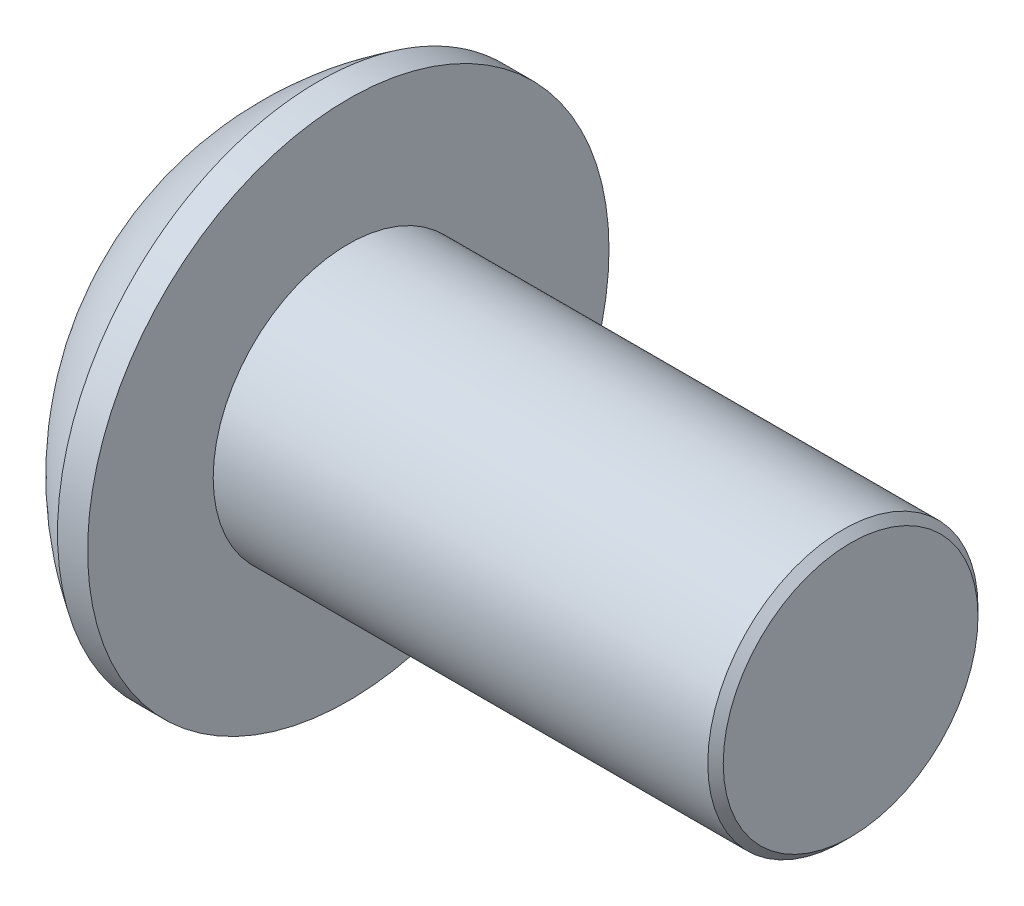
ISO-10303-21;
HEADER;
FILE_DESCRIPTION(('STEP AP214'),'2;1');
FILE_NAME('part.step','',(''),(''),'','','');
FILE_SCHEMA(('AUTOMOTIVE_DESIGN { 1 0 10303 214 1 1 1 1 }'));
ENDSEC;
DATA;
#1=APPLICATION_CONTEXT('core data for automotive mechanical design processes');
#2=APPLICATION_PROTOCOL_DEFINITION('international standard','automotive_design',2000,#1);
#3=PRODUCT_CONTEXT('',#1,'mechanical');
#4=PRODUCT('Part','Part','',(#3));
#5=PRODUCT_RELATED_PRODUCT_CATEGORY('part','',(#4));
#6=PRODUCT_DEFINITION_FORMATION('','',#4);
#7=PRODUCT_DEFINITION_CONTEXT('part definition',#1,'design');
#8=PRODUCT_DEFINITION('design','',#6,#7);
#9=PRODUCT_DEFINITION_SHAPE('','',#8);
#10=(LENGTH_UNIT() NAMED_UNIT(*) SI_UNIT(.MILLI.,.METRE.));
#11=(NAMED_UNIT(*) PLANE_ANGLE_UNIT() SI_UNIT($,.RADIAN.));
#12=(NAMED_UNIT(*) SI_UNIT($,.STERADIAN.) SOLID_ANGLE_UNIT());
#13=UNCERTAINTY_MEASURE_WITH_UNIT(LENGTH_MEASURE(1.E-05),#10,'distance_accuracy_value','');
#14=(GEOMETRIC_REPRESENTATION_CONTEXT(3) GLOBAL_UNCERTAINTY_ASSIGNED_CONTEXT((#13)) GLOBAL_UNIT_ASSIGNED_CONTEXT((#10,
#11,#12)) REPRESENTATION_CONTEXT('',''));
#15=CARTESIAN_POINT('',(0.,0.,0.));
#16=DIRECTION('',(0.,0.,1.));
#17=DIRECTION('',(1.,0.,0.));
#18=AXIS2_PLACEMENT_3D('',#15,#16,#17);
#19=CARTESIAN_POINT('',(1.32080000000034,0.,0.));
#20=DIRECTION('',(-1.,0.,0.));
#21=DIRECTION('',(0.,0.,-1.));
#22=AXIS2_PLACEMENT_3D('',#19,#20,#21);
#23=CONICAL_SURFACE('',#22,1.1937999999998,1.04719755119608);
#24=CARTESIAN_POINT('',(2.01004075135902,0.,-4.44089209850063E-13));
#25=VERTEX_POINT('',#24);
#26=VERTEX_LOOP('',#25);
#27=FACE_BOUND('',#26,.T.);
#28=CARTESIAN_POINT('',(1.32080000000009,0.,0.));
#29=DIRECTION('',(1.,0.,0.));
#30=DIRECTION('',(0.,0.,-1.));
#31=AXIS2_PLACEMENT_3D('',#28,#29,#30);
#32=CIRCLE('',#31,1.19380000000024);
#33=CARTESIAN_POINT('',(1.32080000000004,-1.03386112703797,-0.596900000000061));
#34=VERTEX_POINT('',#33);
#35=CARTESIAN_POINT('',(1.32080000000004,0.,-1.19380000000012));
#36=VERTEX_POINT('',#35);
#37=EDGE_CURVE('E40',#34,#36,#32,.T.);
#38=ORIENTED_EDGE('',*,*,#37,.F.);
#39=CARTESIAN_POINT('',(1.32080000000009,0.,0.));
#40=DIRECTION('',(1.,0.,0.));
#41=DIRECTION('',(0.,0.,-1.));
#42=AXIS2_PLACEMENT_3D('',#39,#40,#41);
#43=CIRCLE('',#42,1.19380000000024);
#44=CARTESIAN_POINT('',(1.32080000000004,-1.03386112703797,0.596900000000061));
#45=VERTEX_POINT('',#44);
#46=EDGE_CURVE('E130',#45,#34,#43,.T.);
#47=ORIENTED_EDGE('',*,*,#46,.F.);
#48=CARTESIAN_POINT('',(1.32080000000009,0.,0.));
#49=DIRECTION('',(1.,0.,0.));
#50=DIRECTION('',(0.,0.,-1.));
#51=AXIS2_PLACEMENT_3D('',#48,#49,#50);
#52=CIRCLE('',#51,1.19380000000024);
#53=CARTESIAN_POINT('',(1.32080000000004,1.49457637585666E-12,1.19380000000012));
#54=VERTEX_POINT('',#53);
#55=EDGE_CURVE('E136',#54,#45,#52,.T.);
#56=ORIENTED_EDGE('',*,*,#55,.F.);
#57=CARTESIAN_POINT('',(1.32080000000009,0.,0.));
#58=DIRECTION('',(1.,0.,0.));
#59=DIRECTION('',(0.,0.,-1.));
#60=AXIS2_PLACEMENT_3D('',#57,#58,#59);
#61=CIRCLE('',#60,1.19380000000024);
#62=CARTESIAN_POINT('',(1.32080000000004,1.03386112703797,0.59690000000006));
#63=VERTEX_POINT('',#62);
#64=EDGE_CURVE('E150',#63,#54,#61,.T.);
#65=ORIENTED_EDGE('',*,*,#64,.F.);
#66=CARTESIAN_POINT('',(1.32080000000009,0.,0.));
#67=DIRECTION('',(1.,0.,0.));
#68=DIRECTION('',(0.,0.,-1.));
#69=AXIS2_PLACEMENT_3D('',#66,#67,#68);
#70=CIRCLE('',#69,1.19380000000024);
#71=CARTESIAN_POINT('',(1.32080000000004,1.03386112703797,-0.59690000000006));
#72=VERTEX_POINT('',#71);
#73=EDGE_CURVE('E143',#72,#63,#70,.T.);
#74=ORIENTED_EDGE('',*,*,#73,.F.);
#75=CARTESIAN_POINT('',(1.32080000000009,0.,0.));
#76=DIRECTION('',(1.,0.,0.));
#77=DIRECTION('',(0.,0.,-1.));
#78=AXIS2_PLACEMENT_3D('',#75,#76,#77);
#79=CIRCLE('',#78,1.19380000000024);
#80=EDGE_CURVE('E140',#36,#72,#79,.T.);
#81=ORIENTED_EDGE('',*,*,#80,.F.);
#82=EDGE_LOOP('',(#38,#47,#56,#65,#74,#81));
#83=FACE_BOUND('',#82,.T.);
#84=ADVANCED_FACE('F37',(#27,#83),#23,.F.);
#85=CARTESIAN_POINT('',(1.3208,-2.06772225407573,1.1938));
#86=DIRECTION('',(1.,0.,0.));
#87=DIRECTION('',(0.,0.,1.));
#88=AXIS2_PLACEMENT_3D('',#85,#86,#87);
#89=PLANE('',#88);
#90=DIRECTION('',(0.,0.5,-0.866025403784439));
#91=VECTOR('',#90,1.);
#92=CARTESIAN_POINT('',(1.3208,-1.37848150271715,0.));
#93=LINE('',#92,#91);
#94=CARTESIAN_POINT('',(1.3208,-0.689240751358575,-1.1938));
#95=VERTEX_POINT('',#94);
#96=EDGE_CURVE('E112',#95,#34,#93,.F.);
#97=ORIENTED_EDGE('',*,*,#96,.T.);
#98=ORIENTED_EDGE('',*,*,#37,.T.);
#99=DIRECTION('',(0.,1.,0.));
#100=VECTOR('',#99,1.);
#101=CARTESIAN_POINT('',(1.3208,-0.689240751358575,-1.1938));
#102=LINE('',#101,#100);
#103=EDGE_CURVE('E127',#36,#95,#102,.F.);
#104=ORIENTED_EDGE('',*,*,#103,.T.);
#105=EDGE_LOOP('',(#97,#98,#104));
#106=FACE_BOUND('',#105,.T.);
#107=ADVANCED_FACE('F124',(#106),#89,.F.);
#108=CARTESIAN_POINT('',(1.3208,-2.06772225407573,1.1938));
#109=DIRECTION('',(1.,0.,0.));
#110=DIRECTION('',(0.,0.,1.));
#111=AXIS2_PLACEMENT_3D('',#108,#109,#110);
#112=PLANE('',#111);
#113=DIRECTION('',(0.,-0.5,-0.866025403784439));
#114=VECTOR('',#113,1.);
#115=CARTESIAN_POINT('',(1.3208,-0.689240751358575,1.1938));
#116=LINE('',#115,#114);
#117=CARTESIAN_POINT('',(1.3208,-1.37848150271715,0.));
#118=VERTEX_POINT('',#117);
#119=EDGE_CURVE('E132',#118,#45,#116,.F.);
#120=ORIENTED_EDGE('',*,*,#119,.T.);
#121=ORIENTED_EDGE('',*,*,#46,.T.);
#122=DIRECTION('',(0.,0.5,-0.866025403784439));
#123=VECTOR('',#122,1.);
#124=CARTESIAN_POINT('',(1.3208,-1.37848150271715,0.));
#125=LINE('',#124,#123);
#126=EDGE_CURVE('E107',#34,#118,#125,.F.);
#127=ORIENTED_EDGE('',*,*,#126,.T.);
#128=EDGE_LOOP('',(#120,#121,#127));
#129=FACE_BOUND('',#128,.T.);
#130=ADVANCED_FACE('F131',(#129),#112,.F.);
#131=CARTESIAN_POINT('',(1.3208,-2.06772225407573,1.1938));
#132=DIRECTION('',(1.,0.,0.));
#133=DIRECTION('',(0.,0.,1.));
#134=AXIS2_PLACEMENT_3D('',#131,#132,#133);
#135=PLANE('',#134);
#136=DIRECTION('',(0.,1.,0.));
#137=VECTOR('',#136,1.);
#138=CARTESIAN_POINT('',(1.3208,0.689240751358575,1.1938));
#139=LINE('',#138,#137);
#140=CARTESIAN_POINT('',(1.3208,-0.689240751358575,1.1938));
#141=VERTEX_POINT('',#140);
#142=EDGE_CURVE('E168',#141,#54,#139,.T.);
#143=ORIENTED_EDGE('',*,*,#142,.T.);
#144=ORIENTED_EDGE('',*,*,#55,.T.);
#145=DIRECTION('',(0.,-0.5,-0.866025403784439));
#146=VECTOR('',#145,1.);
#147=CARTESIAN_POINT('',(1.3208,-0.689240751358575,1.1938));
#148=LINE('',#147,#146);
#149=EDGE_CURVE('E166',#45,#141,#148,.F.);
#150=ORIENTED_EDGE('',*,*,#149,.T.);
#151=EDGE_LOOP('',(#143,#144,#150));
#152=FACE_BOUND('',#151,.T.);
#153=ADVANCED_FACE('F165',(#152),#135,.F.);
#154=CARTESIAN_POINT('',(1.3208,-2.06772225407573,1.1938));
#155=DIRECTION('',(1.,0.,0.));
#156=DIRECTION('',(0.,0.,1.));
#157=AXIS2_PLACEMENT_3D('',#154,#155,#156);
#158=PLANE('',#157);
#159=DIRECTION('',(0.,-0.499999999999999,0.866025403784439));
#160=VECTOR('',#159,1.);
#161=CARTESIAN_POINT('',(1.3208,1.37848150271715,0.));
#162=LINE('',#161,#160);
#163=CARTESIAN_POINT('',(1.3208,0.689240751358575,1.1938));
#164=VERTEX_POINT('',#163);
#165=EDGE_CURVE('E175',#164,#63,#162,.F.);
#166=ORIENTED_EDGE('',*,*,#165,.T.);
#167=ORIENTED_EDGE('',*,*,#64,.T.);
#168=DIRECTION('',(0.,1.,0.));
#169=VECTOR('',#168,1.);
#170=CARTESIAN_POINT('',(1.3208,0.689240751358575,1.1938));
#171=LINE('',#170,#169);
#172=EDGE_CURVE('E173',#54,#164,#171,.T.);
#173=ORIENTED_EDGE('',*,*,#172,.T.);
#174=EDGE_LOOP('',(#166,#167,#173));
#175=FACE_BOUND('',#174,.T.);
#176=ADVANCED_FACE('F172',(#175),#158,.F.);
#177=CARTESIAN_POINT('',(1.3208,-2.06772225407573,1.1938));
#178=DIRECTION('',(1.,0.,0.));
#179=DIRECTION('',(0.,0.,1.));
#180=AXIS2_PLACEMENT_3D('',#177,#178,#179);
#181=PLANE('',#180);
#182=DIRECTION('',(0.,0.499999999999999,0.866025403784439));
#183=VECTOR('',#182,1.);
#184=CARTESIAN_POINT('',(1.3208,0.689240751358575,-1.1938));
#185=LINE('',#184,#183);
#186=CARTESIAN_POINT('',(1.3208,1.37848150271715,0.));
#187=VERTEX_POINT('',#186);
#188=EDGE_CURVE('E186',#187,#72,#185,.F.);
#189=ORIENTED_EDGE('',*,*,#188,.T.);
#190=ORIENTED_EDGE('',*,*,#73,.T.);
#191=DIRECTION('',(0.,-0.499999999999999,0.866025403784439));
#192=VECTOR('',#191,1.);
#193=CARTESIAN_POINT('',(1.3208,1.37848150271715,0.));
#194=LINE('',#193,#192);
#195=EDGE_CURVE('E178',#63,#187,#194,.F.);
#196=ORIENTED_EDGE('',*,*,#195,.T.);
#197=EDGE_LOOP('',(#189,#190,#196));
#198=FACE_BOUND('',#197,.T.);
#199=ADVANCED_FACE('F184',(#198),#181,.F.);
#200=CARTESIAN_POINT('',(1.3208,-2.06772225407573,1.1938));
#201=DIRECTION('',(1.,0.,0.));
#202=DIRECTION('',(0.,0.,1.));
#203=AXIS2_PLACEMENT_3D('',#200,#201,#202);
#204=PLANE('',#203);
#205=DIRECTION('',(0.,1.,0.));
#206=VECTOR('',#205,1.);
#207=CARTESIAN_POINT('',(1.3208,-0.689240751358575,-1.1938));
#208=LINE('',#207,#206);
#209=CARTESIAN_POINT('',(1.3208,0.689240751358575,-1.1938));
#210=VERTEX_POINT('',#209);
#211=EDGE_CURVE('E147',#210,#36,#208,.F.);
#212=ORIENTED_EDGE('',*,*,#211,.T.);
#213=ORIENTED_EDGE('',*,*,#80,.T.);
#214=DIRECTION('',(0.,0.499999999999999,0.866025403784439));
#215=VECTOR('',#214,1.);
#216=CARTESIAN_POINT('',(1.3208,0.689240751358575,-1.1938));
#217=LINE('',#216,#215);
#218=EDGE_CURVE('E188',#72,#210,#217,.F.);
#219=ORIENTED_EDGE('',*,*,#218,.T.);
#220=EDGE_LOOP('',(#212,#213,#219));
#221=FACE_BOUND('',#220,.T.);
#222=ADVANCED_FACE('F309',(#221),#204,.F.);
#223=CARTESIAN_POINT('',(1.3208,-0.689240751358575,-1.1938));
#224=DIRECTION('',(0.,0.,1.));
#225=DIRECTION('',(0.,1.,0.));
#226=AXIS2_PLACEMENT_3D('',#223,#224,#225);
#227=PLANE('',#226);
#228=DIRECTION('',(0.,1.,0.));
#229=VECTOR('',#228,1.);
#230=CARTESIAN_POINT('',(0.,0.,-1.1938));
#231=LINE('',#230,#229);
#232=CARTESIAN_POINT('',(0.,0.689240751358575,-1.1938));
#233=VERTEX_POINT('',#232);
#234=CARTESIAN_POINT('',(0.,-0.689240751358575,-1.1938));
#235=VERTEX_POINT('',#234);
#236=EDGE_CURVE('E196',#233,#235,#231,.F.);
#237=ORIENTED_EDGE('',*,*,#236,.T.);
#238=DIRECTION('',(1.,0.,0.));
#239=VECTOR('',#238,1.);
#240=CARTESIAN_POINT('',(1.3208,-0.689240751358575,-1.1938));
#241=LINE('',#240,#239);
#242=EDGE_CURVE('E119',#235,#95,#241,.T.);
#243=ORIENTED_EDGE('',*,*,#242,.T.);
#244=ORIENTED_EDGE('',*,*,#103,.F.);
#245=ORIENTED_EDGE('',*,*,#211,.F.);
#246=DIRECTION('',(1.,0.,0.));
#247=VECTOR('',#246,1.);
#248=CARTESIAN_POINT('',(1.3208,0.689240751358575,-1.1938));
#249=LINE('',#248,#247);
#250=EDGE_CURVE('E191',#210,#233,#249,.F.);
#251=ORIENTED_EDGE('',*,*,#250,.T.);
#252=EDGE_LOOP('',(#237,#243,#244,#245,#251));
#253=FACE_BOUND('',#252,.T.);
#254=ADVANCED_FACE('F275',(#253),#227,.T.);
#255=CARTESIAN_POINT('',(1.3208,-1.37848150271715,0.));
#256=DIRECTION('',(0.,0.866025403784439,0.5));
#257=DIRECTION('',(0.,0.5,-0.866025403784439));
#258=AXIS2_PLACEMENT_3D('',#255,#256,#257);
#259=PLANE('',#258);
#260=DIRECTION('',(0.,-0.5,0.866025403784439));
#261=VECTOR('',#260,1.);
#262=CARTESIAN_POINT('',(0.,-0.689240751358575,-1.1938));
#263=LINE('',#262,#261);
#264=CARTESIAN_POINT('',(0.,-1.37848150271715,0.));
#265=VERTEX_POINT('',#264);
#266=EDGE_CURVE('E272',#235,#265,#263,.T.);
#267=ORIENTED_EDGE('',*,*,#266,.T.);
#268=DIRECTION('',(1.,0.,0.));
#269=VECTOR('',#268,1.);
#270=CARTESIAN_POINT('',(1.3208,-1.37848150271715,0.));
#271=LINE('',#270,#269);
#272=EDGE_CURVE('E114',#265,#118,#271,.T.);
#273=ORIENTED_EDGE('',*,*,#272,.T.);
#274=ORIENTED_EDGE('',*,*,#126,.F.);
#275=ORIENTED_EDGE('',*,*,#96,.F.);
#276=ORIENTED_EDGE('',*,*,#242,.F.);
#277=EDGE_LOOP('',(#267,#273,#274,#275,#276));
#278=FACE_BOUND('',#277,.T.);
#279=ADVANCED_FACE('F110',(#278),#259,.T.);
#280=CARTESIAN_POINT('',(1.3208,-0.689240751358575,1.1938));
#281=DIRECTION('',(0.,0.866025403784439,-0.5));
#282=DIRECTION('',(0.,-0.5,-0.866025403784439));
#283=AXIS2_PLACEMENT_3D('',#280,#281,#282);
#284=PLANE('',#283);
#285=DIRECTION('',(0.,0.5,0.866025403784439));
#286=VECTOR('',#285,1.);
#287=CARTESIAN_POINT('',(0.,-1.37848150271715,0.));
#288=LINE('',#287,#286);
#289=CARTESIAN_POINT('',(0.,-0.689240751358575,1.1938));
#290=VERTEX_POINT('',#289);
#291=EDGE_CURVE('E270',#265,#290,#288,.T.);
#292=ORIENTED_EDGE('',*,*,#291,.T.);
#293=DIRECTION('',(1.,0.,0.));
#294=VECTOR('',#293,1.);
#295=CARTESIAN_POINT('',(1.3208,-0.689240751358575,1.1938));
#296=LINE('',#295,#294);
#297=EDGE_CURVE('E179',#290,#141,#296,.T.);
#298=ORIENTED_EDGE('',*,*,#297,.T.);
#299=ORIENTED_EDGE('',*,*,#149,.F.);
#300=ORIENTED_EDGE('',*,*,#119,.F.);
#301=ORIENTED_EDGE('',*,*,#272,.F.);
#302=EDGE_LOOP('',(#292,#298,#299,#300,#301));
#303=FACE_BOUND('',#302,.T.);
#304=ADVANCED_FACE('F280',(#303),#284,.T.);
#305=CARTESIAN_POINT('',(1.3208,0.689240751358575,1.1938));
#306=DIRECTION('',(0.,0.,-1.));
#307=DIRECTION('',(1.,0.,0.));
#308=AXIS2_PLACEMENT_3D('',#305,#306,#307);
#309=PLANE('',#308);
#310=DIRECTION('',(0.,1.,0.));
#311=VECTOR('',#310,1.);
#312=CARTESIAN_POINT('',(0.,0.,1.1938));
#313=LINE('',#312,#311);
#314=CARTESIAN_POINT('',(0.,0.689240751358575,1.1938));
#315=VERTEX_POINT('',#314);
#316=EDGE_CURVE('E262',#290,#315,#313,.T.);
#317=ORIENTED_EDGE('',*,*,#316,.T.);
#318=DIRECTION('',(1.,0.,0.));
#319=VECTOR('',#318,1.);
#320=CARTESIAN_POINT('',(1.3208,0.689240751358575,1.1938));
#321=LINE('',#320,#319);
#322=EDGE_CURVE('E189',#315,#164,#321,.T.);
#323=ORIENTED_EDGE('',*,*,#322,.T.);
#324=ORIENTED_EDGE('',*,*,#172,.F.);
#325=ORIENTED_EDGE('',*,*,#142,.F.);
#326=ORIENTED_EDGE('',*,*,#297,.F.);
#327=EDGE_LOOP('',(#317,#323,#324,#325,#326));
#328=FACE_BOUND('',#327,.T.);
#329=ADVANCED_FACE('F282',(#328),#309,.T.);
#330=CARTESIAN_POINT('',(1.3208,1.37848150271715,0.));
#331=DIRECTION('',(0.,-0.866025403784439,-0.499999999999999));
#332=DIRECTION('',(0.,-0.499999999999999,0.866025403784439));
#333=AXIS2_PLACEMENT_3D('',#330,#331,#332);
#334=PLANE('',#333);
#335=DIRECTION('',(0.,0.499999999999999,-0.866025403784439));
#336=VECTOR('',#335,1.);
#337=CARTESIAN_POINT('',(0.,0.689240751358575,1.1938));
#338=LINE('',#337,#336);
#339=CARTESIAN_POINT('',(0.,1.37848150271715,0.));
#340=VERTEX_POINT('',#339);
#341=EDGE_CURVE('E259',#315,#340,#338,.T.);
#342=ORIENTED_EDGE('',*,*,#341,.T.);
#343=DIRECTION('',(1.,0.,0.));
#344=VECTOR('',#343,1.);
#345=CARTESIAN_POINT('',(1.3208,1.37848150271715,0.));
#346=LINE('',#345,#344);
#347=EDGE_CURVE('E204',#340,#187,#346,.T.);
#348=ORIENTED_EDGE('',*,*,#347,.T.);
#349=ORIENTED_EDGE('',*,*,#195,.F.);
#350=ORIENTED_EDGE('',*,*,#165,.F.);
#351=ORIENTED_EDGE('',*,*,#322,.F.);
#352=EDGE_LOOP('',(#342,#348,#349,#350,#351));
#353=FACE_BOUND('',#352,.T.);
#354=ADVANCED_FACE('F283',(#353),#334,.T.);
#355=CARTESIAN_POINT('',(1.3208,0.689240751358575,-1.1938));
#356=DIRECTION('',(0.,-0.866025403784439,0.499999999999999));
#357=DIRECTION('',(0.,0.499999999999999,0.866025403784439));
#358=AXIS2_PLACEMENT_3D('',#355,#356,#357);
#359=PLANE('',#358);
#360=DIRECTION('',(0.,-0.499999999999999,-0.866025403784439));
#361=VECTOR('',#360,1.);
#362=CARTESIAN_POINT('',(0.,1.37848150271715,0.));
#363=LINE('',#362,#361);
#364=EDGE_CURVE('E55',#340,#233,#363,.T.);
#365=ORIENTED_EDGE('',*,*,#364,.T.);
#366=ORIENTED_EDGE('',*,*,#250,.F.);
#367=ORIENTED_EDGE('',*,*,#218,.F.);
#368=ORIENTED_EDGE('',*,*,#188,.F.);
#369=ORIENTED_EDGE('',*,*,#347,.F.);
#370=EDGE_LOOP('',(#365,#366,#367,#368,#369));
#371=FACE_BOUND('',#370,.T.);
#372=ADVANCED_FACE('F284',(#371),#359,.T.);
#373=CARTESIAN_POINT('',(0.,0.,0.));
#374=DIRECTION('',(-1.,0.,0.));
#375=DIRECTION('',(0.,0.,-1.));
#376=AXIS2_PLACEMENT_3D('',#373,#374,#375);
#377=PLANE('',#376);
#378=ORIENTED_EDGE('',*,*,#341,.F.);
#379=ORIENTED_EDGE('',*,*,#316,.F.);
#380=ORIENTED_EDGE('',*,*,#291,.F.);
#381=ORIENTED_EDGE('',*,*,#266,.F.);
#382=ORIENTED_EDGE('',*,*,#236,.F.);
#383=ORIENTED_EDGE('',*,*,#364,.F.);
#384=EDGE_LOOP('',(#378,#379,#380,#381,#382,#383));
#385=FACE_BOUND('',#384,.T.);
#386=CARTESIAN_POINT('',(0.,1.647825,0.));
#387=CARTESIAN_POINT('',(1.63301334336493E-13,1.64781976319873,-0.0924902039777531));
#388=CARTESIAN_POINT('',(1.32757099051758E-13,1.63999511633709,-0.18514501432637));
#389=CARTESIAN_POINT('',(0.,1.6167119250047,-0.322075808080014));
#390=CARTESIAN_POINT('',(-1.58305041826433E-13,1.60700618770234,-0.36743553339636));
#391=CARTESIAN_POINT('',(1.58867632387879E-13,1.58380101865852,-0.45722093569514));
#392=CARTESIAN_POINT('',(5.685256041377E-13,1.5702985083103,-0.501645823115263));
#393=CARTESIAN_POINT('',(9.36225516729674E-13,1.52428156574313,-0.632817459278967));
#394=CARTESIAN_POINT('',(0.,1.48621992666366,-0.717681965518644));
#395=CARTESIAN_POINT('',(0.,1.39637079695658,-0.879809706624016));
#396=CARTESIAN_POINT('',(7.8098507899763E-13,1.34458278455109,-0.957072652379994));
#397=CARTESIAN_POINT('',(4.86281509884467E-13,1.25777784714521,-1.06558770210237));
#398=CARTESIAN_POINT('',(1.33300448789343E-13,1.22729946114793,-1.10054993332365));
#399=CARTESIAN_POINT('',(-1.32738455277453E-13,1.16354004969106,-1.16775237388221));
#400=CARTESIAN_POINT('',(0.,1.13026175473032,-1.19999517515816));
#401=CARTESIAN_POINT('',(0.,1.02649304340867,-1.29236218866442));
#402=CARTESIAN_POINT('',(0.,0.952049986714076,-1.34814848277713));
#403=CARTESIAN_POINT('',(0.,0.794895196754067,-1.44639825105766));
#404=CARTESIAN_POINT('',(0.,0.712183775431294,-1.48886222758992));
#405=CARTESIAN_POINT('',(0.,0.540796624265727,-1.55930919813143));
#406=CARTESIAN_POINT('',(0.,0.452120958135283,-1.58729234680268));
#407=CARTESIAN_POINT('',(0.,0.271332331080313,-1.62797191307413));
#408=CARTESIAN_POINT('',(0.,0.179219351801785,-1.64066824903626));
#409=CARTESIAN_POINT('',(0.,-0.00583077027841204,-1.65041748705409));
#410=CARTESIAN_POINT('',(0.,-0.0987679130800814,-1.64747038910979));
#411=CARTESIAN_POINT('',(0.,-0.282830196388828,-1.62601274134436));
#412=CARTESIAN_POINT('',(0.,-0.373955346570021,-1.60750227463794));
#413=CARTESIAN_POINT('',(0.,-0.551796068178807,-1.55545413364524));
#414=CARTESIAN_POINT('',(0.,-0.638511592498169,-1.52191629885844));
#415=CARTESIAN_POINT('',(0.,-0.805120175533157,-1.44072378052347));
#416=CARTESIAN_POINT('',(0.,-0.88501297681996,-1.39306856461393));
#417=CARTESIAN_POINT('',(0.,-0.997912879588363,-1.31211658756413));
#418=CARTESIAN_POINT('',(0.,-1.0343949246834,-1.28354906167734));
#419=CARTESIAN_POINT('',(0.,-1.10486279842069,-1.22341829303709));
#420=CARTESIAN_POINT('',(0.,-1.13884618403291,-1.19185218578117));
#421=CARTESIAN_POINT('',(0.,-1.23657300939909,-1.09305906467359));
#422=CARTESIAN_POINT('',(0.,-1.29619288399357,-1.02166556658613));
#423=CARTESIAN_POINT('',(0.,-1.40258050817756,-0.869876423478034));
#424=CARTESIAN_POINT('',(0.,-1.44934874627766,-0.789481120793478));
#425=CARTESIAN_POINT('',(0.,-1.50889406070376,-0.663870959313342));
#426=CARTESIAN_POINT('',(0.,-1.52698985473587,-0.621110806760429));
#427=CARTESIAN_POINT('',(0.,-1.55950093966665,-0.534260776864333));
#428=CARTESIAN_POINT('',(-1.05107454759256E-13,-1.57391920916438,-0.49017200820317));
#429=CARTESIAN_POINT('',(2.10313179674657E-13,-1.6114617790958,-0.356445777718598));
#430=CARTESIAN_POINT('',(1.14393074710782E-12,-1.62897899568075,-0.265126085962908));
#431=CARTESIAN_POINT('',(4.34745916884307E-13,-1.64174347214909,-0.144386595969389));
#432=CARTESIAN_POINT('',(1.21687212484297E-13,-1.64402207668916,-0.115560405797875));
#433=CARTESIAN_POINT('',(-1.21253531615378E-13,-1.64706365940121,-0.05782817572527));
#434=CARTESIAN_POINT('',(0.,-1.64782663757319,-0.0289221358241781));
#435=CARTESIAN_POINT('',(1.63526630611819E-13,-1.64781976319875,0.0924902039777539));
#436=CARTESIAN_POINT('',(1.32928193376509E-13,-1.6399951163371,0.185145014326371));
#437=CARTESIAN_POINT('',(0.,-1.61671192500471,0.322075808080014));
#438=CARTESIAN_POINT('',(-1.5850596280799E-13,-1.60700618770235,0.367435533396361));
#439=CARTESIAN_POINT('',(1.59068716757996E-13,-1.58380101865854,0.457220935695141));
#440=CARTESIAN_POINT('',(5.69244357076647E-13,-1.57029850831031,0.501645823115264));
#441=CARTESIAN_POINT('',(9.37389387665157E-13,-1.52428156574314,0.632817459278967));
#442=CARTESIAN_POINT('',(0.,-1.48621992666367,0.717681965518644));
#443=CARTESIAN_POINT('',(0.,-1.39637079695659,0.879809706624016));
#444=CARTESIAN_POINT('',(7.82184361546168E-13,-1.3445827845511,0.957072652379994));
#445=CARTESIAN_POINT('',(4.8698269374705E-13,-1.25777784714522,1.06558770210237));
#446=CARTESIAN_POINT('',(1.33453863497427E-13,-1.22729946114795,1.10054993332365));
#447=CARTESIAN_POINT('',(-1.32891722070652E-13,-1.16354004969108,1.16775237388221));
#448=CARTESIAN_POINT('',(0.,-1.13026175473034,1.19999517515816));
#449=CARTESIAN_POINT('',(0.,-1.02649304340868,1.29236218866442));
#450=CARTESIAN_POINT('',(0.,-0.95204998671409,1.34814848277713));
#451=CARTESIAN_POINT('',(0.,-0.794895196754081,1.44639825105766));
#452=CARTESIAN_POINT('',(0.,-0.712183775431308,1.48886222758992));
#453=CARTESIAN_POINT('',(0.,-0.54079662426574,1.55930919813143));
#454=CARTESIAN_POINT('',(0.,-0.452120958135296,1.58729234680268));
#455=CARTESIAN_POINT('',(0.,-0.271332331080326,1.62797191307413));
#456=CARTESIAN_POINT('',(0.,-0.179219351801799,1.64066824903626));
#457=CARTESIAN_POINT('',(0.,0.00583077027839793,1.65041748705409));
#458=CARTESIAN_POINT('',(0.,0.098767913080067,1.64747038910979));
#459=CARTESIAN_POINT('',(0.,0.282830196388814,1.62601274134436));
#460=CARTESIAN_POINT('',(0.,0.373955346570008,1.60750227463794));
#461=CARTESIAN_POINT('',(0.,0.551796068178794,1.55545413364524));
#462=CARTESIAN_POINT('',(0.,0.638511592498155,1.52191629885844));
#463=CARTESIAN_POINT('',(0.,0.805120175533143,1.44072378052347));
#464=CARTESIAN_POINT('',(0.,0.885012976819945,1.39306856461393));
#465=CARTESIAN_POINT('',(0.,0.997912879588349,1.31211658756413));
#466=CARTESIAN_POINT('',(0.,1.03439492468339,1.28354906167734));
#467=CARTESIAN_POINT('',(0.,1.10486279842068,1.2234182930371));
#468=CARTESIAN_POINT('',(0.,1.1388461840329,1.19185218578118));
#469=CARTESIAN_POINT('',(0.,1.23657300939907,1.09305906467359));
#470=CARTESIAN_POINT('',(0.,1.29619288399356,1.02166556658613));
#471=CARTESIAN_POINT('',(0.,1.40258050817754,0.869876423478033));
#472=CARTESIAN_POINT('',(0.,1.44934874627765,0.789481120793477));
#473=CARTESIAN_POINT('',(0.,1.50889406070374,0.663870959313341));
#474=CARTESIAN_POINT('',(0.,1.52698985473586,0.621110806760428));
#475=CARTESIAN_POINT('',(0.,1.55950093966663,0.534260776864332));
#476=CARTESIAN_POINT('',(-1.05168985037331E-13,1.57391920916437,0.490172008203169));
#477=CARTESIAN_POINT('',(2.10435917606606E-13,1.61146177909578,0.356445777718597));
#478=CARTESIAN_POINT('',(1.1439227149816E-12,1.62897899568074,0.265126085962907));
#479=CARTESIAN_POINT('',(4.34748428569173E-13,1.64174347214908,0.144386595969389));
#480=CARTESIAN_POINT('',(1.21705808532127E-13,1.64402207668915,0.115560405797875));
#481=CARTESIAN_POINT('',(-1.21272127663207E-13,1.6470636594012,0.0578281757252704));
#482=CARTESIAN_POINT('',(0.,1.64782663757318,0.0289221358241788));
#483=CARTESIAN_POINT('',(0.,1.647825,0.));
#484=B_SPLINE_CURVE_WITH_KNOTS('',3,(#386,#387,#388,#389,#390,#391,#392,#393,#394,#395,#396,
#397,#398,#399,#400,#401,#402,#403,#404,#405,#406,#407,#408,#409,#410,#411,#412,#413,#414,#415,
#416,#417,#418,#419,#420,#421,#422,#423,#424,#425,#426,#427,#428,#429,#430,#431,#432,#433,#434,
#435,#436,#437,#438,#439,#440,#441,#442,#443,#444,#445,#446,#447,#448,#449,#450,#451,#452,#453,
#454,#455,#456,#457,#458,#459,#460,#461,#462,#463,#464,#465,#466,#467,#468,#469,#470,#471,#472,
#473,#474,#475,#476,#477,#478,#479,#480,#481,#482,#483),.UNSPECIFIED.,.T.,.F.,(4,2,2,2,2,2,2,2,
2,2,2,2,2,2,2,2,2,2,2,2,2,2,2,2,2,2,2,2,2,2,2,2,2,2,2,2,2,2,2,2,2,2,2,2,2,2,2,2,4),(0.,
0.277336029422426,0.416368541537111,0.5555141146256,0.833141970294987,1.11078038089036,
1.24978149120748,1.38864858351854,1.66629367015056,1.94392828594775,2.22155993641642,
2.49919306954937,2.77682620268234,3.05445785315102,3.3320924689482,3.6097375555799,
3.74860464789075,3.88760575820768,4.16524416880333,4.44287202447288,4.58201759756161,
4.72105010967662,4.99838613909883,5.08511046196678,5.17183478483477,5.4491708142572,
5.58820332637189,5.72734889946037,6.00497675512976,6.28261516572514,6.42161627604225,
6.56048336835332,6.83812845498533,7.11576307078252,7.3933947212512,7.67102785438415,
7.94866098751711,8.22629263798579,8.50392725378298,8.78157234041468,8.92043943272552,
9.05944054304245,9.3370789536381,9.61470680930765,9.75385238239638,9.8928848945114,
10.1702209239336,10.2569452468015,10.3436695696695),.UNSPECIFIED.);
#485=CARTESIAN_POINT('',(0.,1.647825,0.));
#486=VERTEX_POINT('',#485);
#487=EDGE_CURVE('E153',#486,#486,#484,.T.);
#488=ORIENTED_EDGE('',*,*,#487,.T.);
#489=EDGE_LOOP('',(#488));
#490=FACE_BOUND('',#489,.T.);
#491=ADVANCED_FACE('F277',(#385,#490),#377,.T.);
#492=CARTESIAN_POINT('',(3.50132362607759,0.,0.));
#493=DIRECTION('',(0.,1.,0.));
#494=DIRECTION('',(1.,0.,0.));
#495=AXIS2_PLACEMENT_3D('',#492,#493,#494);
#496=SPHERICAL_SURFACE('',#495,3.86970210289554);
#497=CARTESIAN_POINT('',(1.4732,0.,0.));
#498=DIRECTION('',(1.,0.,0.));
#499=DIRECTION('',(0.,0.,-1.));
#500=AXIS2_PLACEMENT_3D('',#497,#498,#499);
#501=CIRCLE('',#500,3.29565);
#502=CARTESIAN_POINT('',(1.4732,0.,-3.29565));
#503=VERTEX_POINT('',#502);
#504=EDGE_CURVE('E252',#503,#503,#501,.F.);
#505=ORIENTED_EDGE('',*,*,#504,.T.);
#506=EDGE_LOOP('',(#505));
#507=FACE_BOUND('',#506,.T.);
#508=ORIENTED_EDGE('',*,*,#487,.F.);
#509=EDGE_LOOP('',(#508));
#510=FACE_BOUND('',#509,.T.);
#511=ADVANCED_FACE('F291',(#507,#510),#496,.T.);
#512=CARTESIAN_POINT('',(8.2042,0.,0.));
#513=DIRECTION('',(-1.,0.,0.));
#514=DIRECTION('',(0.,0.,-1.));
#515=AXIS2_PLACEMENT_3D('',#512,#513,#514);
#516=PLANE('',#515);
#517=CARTESIAN_POINT('',(8.20420000002287,0.,0.));
#518=DIRECTION('',(1.,0.,0.));
#519=DIRECTION('',(0.,0.,-1.));
#520=AXIS2_PLACEMENT_3D('',#517,#518,#519);
#521=CIRCLE('',#520,1.61036000002923);
#522=CARTESIAN_POINT('',(8.20420000002287,0.,-1.61036000002923));
#523=VERTEX_POINT('',#522);
#524=EDGE_CURVE('E250',#523,#523,#521,.T.);
#525=ORIENTED_EDGE('',*,*,#524,.T.);
#526=EDGE_LOOP('',(#525));
#527=FACE_BOUND('',#526,.T.);
#528=ADVANCED_FACE('F346',(#527),#516,.F.);
#529=CARTESIAN_POINT('',(0.,0.,0.));
#530=DIRECTION('',(-1.,0.,0.));
#531=DIRECTION('',(0.,0.,-1.));
#532=AXIS2_PLACEMENT_3D('',#529,#530,#531);
#533=CYLINDRICAL_SURFACE('',#532,3.29565);
#534=ORIENTED_EDGE('',*,*,#504,.F.);
#535=EDGE_LOOP('',(#534));
#536=FACE_BOUND('',#535,.T.);
#537=CARTESIAN_POINT('',(1.8542,0.,0.));
#538=DIRECTION('',(1.,0.,0.));
#539=DIRECTION('',(0.,0.,-1.));
#540=AXIS2_PLACEMENT_3D('',#537,#538,#539);
#541=CIRCLE('',#540,3.29565);
#542=CARTESIAN_POINT('',(1.8542,0.,-3.29565));
#543=VERTEX_POINT('',#542);
#544=EDGE_CURVE('E247',#543,#543,#541,.T.);
#545=ORIENTED_EDGE('',*,*,#544,.F.);
#546=EDGE_LOOP('',(#545));
#547=FACE_BOUND('',#546,.T.);
#548=ADVANCED_FACE('F354',(#536,#547),#533,.T.);
#549=CARTESIAN_POINT('',(8.10641000009582,0.,0.));
#550=DIRECTION('',(-1.,0.,0.));
#551=DIRECTION('',(0.,0.,-1.));
#552=AXIS2_PLACEMENT_3D('',#549,#550,#551);
#553=CONICAL_SURFACE('',#552,1.70814999989943,0.785398163106808);
#554=CARTESIAN_POINT('',(8.10641000000006,0.,0.));
#555=DIRECTION('',(1.,0.,0.));
#556=DIRECTION('',(0.,0.,-1.));
#557=AXIS2_PLACEMENT_3D('',#554,#555,#556);
#558=CIRCLE('',#557,1.70814999999999);
#559=CARTESIAN_POINT('',(8.10641000000006,0.,-1.70814999999999));
#560=VERTEX_POINT('',#559);
#561=EDGE_CURVE('E46',#560,#560,#558,.T.);
#562=ORIENTED_EDGE('',*,*,#561,.T.);
#563=EDGE_LOOP('',(#562));
#564=FACE_BOUND('',#563,.T.);
#565=ORIENTED_EDGE('',*,*,#524,.F.);
#566=EDGE_LOOP('',(#565));
#567=FACE_BOUND('',#566,.T.);
#568=ADVANCED_FACE('F364',(#564,#567),#553,.T.);
#569=CARTESIAN_POINT('',(1.8542,1.70814999999999,0.));
#570=DIRECTION('',(-1.,0.,0.));
#571=DIRECTION('',(0.,0.,-1.));
#572=AXIS2_PLACEMENT_3D('',#569,#570,#571);
#573=PLANE('',#572);
#574=CARTESIAN_POINT('',(1.8542,0.,0.));
#575=DIRECTION('',(1.,0.,0.));
#576=DIRECTION('',(0.,0.,-1.));
#577=AXIS2_PLACEMENT_3D('',#574,#575,#576);
#578=CIRCLE('',#577,1.70814999999999);
#579=CARTESIAN_POINT('',(1.8542,0.,-1.70814999999999));
#580=VERTEX_POINT('',#579);
#581=EDGE_CURVE('E11',#580,#580,#578,.F.);
#582=ORIENTED_EDGE('',*,*,#581,.T.);
#583=EDGE_LOOP('',(#582));
#584=FACE_BOUND('',#583,.T.);
#585=ORIENTED_EDGE('',*,*,#544,.T.);
#586=EDGE_LOOP('',(#585));
#587=FACE_BOUND('',#586,.T.);
#588=ADVANCED_FACE('F374',(#584,#587),#573,.F.);
#589=CARTESIAN_POINT('',(0.,0.,0.));
#590=DIRECTION('',(-1.,0.,0.));
#591=DIRECTION('',(0.,0.,-1.));
#592=AXIS2_PLACEMENT_3D('',#589,#590,#591);
#593=CYLINDRICAL_SURFACE('',#592,1.70814999999999);
#594=ORIENTED_EDGE('',*,*,#581,.F.);
#595=EDGE_LOOP('',(#594));
#596=FACE_BOUND('',#595,.T.);
#597=ORIENTED_EDGE('',*,*,#561,.F.);
#598=EDGE_LOOP('',(#597));
#599=FACE_BOUND('',#598,.T.);
#600=ADVANCED_FACE('F384',(#596,#599),#593,.T.);
#601=CLOSED_SHELL('',(#84,#107,#130,#153,#176,#199,#222,#254,#279,#304,#329,#354,#372,#491,#511,
#528,#548,#568,#588,#600));
#602=MANIFOLD_SOLID_BREP('B2',#601);
#603=ADVANCED_BREP_SHAPE_REPRESENTATION('',(#18,#602),#14);
#604=SHAPE_DEFINITION_REPRESENTATION(#9,#603);
ENDSEC;
END-ISO-10303-21;
